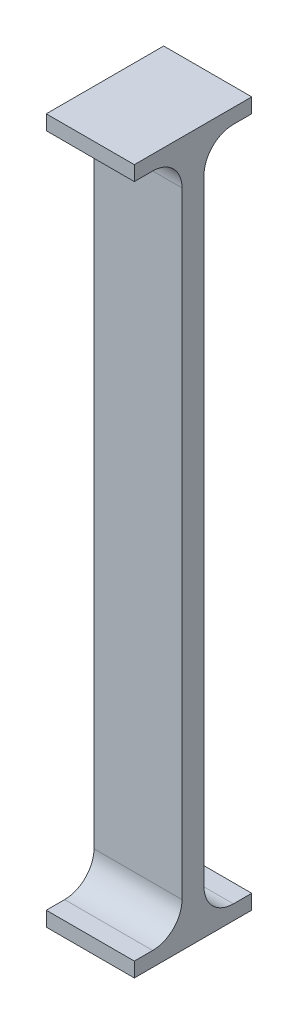
ISO-10303-21;
HEADER;
FILE_DESCRIPTION(('STEP AP214'),'2;1');
FILE_NAME('part.step','',(''),(''),'','','');
FILE_SCHEMA(('AUTOMOTIVE_DESIGN { 1 0 10303 214 1 1 1 1 }'));
ENDSEC;
DATA;
#1=APPLICATION_CONTEXT('core data for automotive mechanical design processes');
#2=APPLICATION_PROTOCOL_DEFINITION('international standard','automotive_design',2000,#1);
#3=PRODUCT_CONTEXT('',#1,'mechanical');
#4=PRODUCT('Part','Part','',(#3));
#5=PRODUCT_RELATED_PRODUCT_CATEGORY('part','',(#4));
#6=PRODUCT_DEFINITION_FORMATION('','',#4);
#7=PRODUCT_DEFINITION_CONTEXT('part definition',#1,'design');
#8=PRODUCT_DEFINITION('design','',#6,#7);
#9=PRODUCT_DEFINITION_SHAPE('','',#8);
#10=(LENGTH_UNIT() NAMED_UNIT(*) SI_UNIT(.MILLI.,.METRE.));
#11=(NAMED_UNIT(*) PLANE_ANGLE_UNIT() SI_UNIT($,.RADIAN.));
#12=(NAMED_UNIT(*) SI_UNIT($,.STERADIAN.) SOLID_ANGLE_UNIT());
#13=UNCERTAINTY_MEASURE_WITH_UNIT(LENGTH_MEASURE(1.E-05),#10,'distance_accuracy_value','');
#14=(GEOMETRIC_REPRESENTATION_CONTEXT(3) GLOBAL_UNCERTAINTY_ASSIGNED_CONTEXT((#13)) GLOBAL_UNIT_ASSIGNED_CONTEXT((#10,
#11,#12)) REPRESENTATION_CONTEXT('',''));
#15=CARTESIAN_POINT('',(0.,0.,0.));
#16=DIRECTION('',(0.,0.,1.));
#17=DIRECTION('',(1.,0.,0.));
#18=AXIS2_PLACEMENT_3D('',#15,#16,#17);
#19=CARTESIAN_POINT('',(0.,0.,3.75));
#20=DIRECTION('',(0.,0.,-1.));
#21=DIRECTION('',(-1.,0.,0.));
#22=AXIS2_PLACEMENT_3D('',#19,#20,#21);
#23=PLANE('',#22);
#24=DIRECTION('',(0.,-1.,0.));
#25=VECTOR('',#24,1.);
#26=CARTESIAN_POINT('',(-15.,0.,3.75));
#27=LINE('',#26,#25);
#28=CARTESIAN_POINT('',(-15.0000000000001,224.95,3.75));
#29=VERTEX_POINT('',#28);
#30=CARTESIAN_POINT('',(-15.,15.,3.75));
#31=VERTEX_POINT('',#30);
#32=EDGE_CURVE('E211',#29,#31,#27,.T.);
#33=ORIENTED_EDGE('',*,*,#32,.T.);
#34=DIRECTION('',(-1.,0.,0.));
#35=VECTOR('',#34,1.);
#36=CARTESIAN_POINT('',(15.,15.,3.75));
#37=LINE('',#36,#35);
#38=CARTESIAN_POINT('',(15.,15.,3.75));
#39=VERTEX_POINT('',#38);
#40=EDGE_CURVE('E60',#31,#39,#37,.F.);
#41=ORIENTED_EDGE('',*,*,#40,.T.);
#42=DIRECTION('',(0.,1.,0.));
#43=VECTOR('',#42,1.);
#44=CARTESIAN_POINT('',(15.,0.,3.75));
#45=LINE('',#44,#43);
#46=CARTESIAN_POINT('',(15.,224.95,3.75));
#47=VERTEX_POINT('',#46);
#48=EDGE_CURVE('E213',#39,#47,#45,.T.);
#49=ORIENTED_EDGE('',*,*,#48,.T.);
#50=DIRECTION('',(1.,0.,0.));
#51=VECTOR('',#50,1.);
#52=CARTESIAN_POINT('',(-15.0000000000001,224.95,3.75));
#53=LINE('',#52,#51);
#54=EDGE_CURVE('E234',#47,#29,#53,.F.);
#55=ORIENTED_EDGE('',*,*,#54,.T.);
#56=EDGE_LOOP('',(#33,#41,#49,#55));
#57=FACE_BOUND('',#56,.T.);
#58=ADVANCED_FACE('F39',(#57),#23,.F.);
#59=CARTESIAN_POINT('',(0.,0.,-3.75));
#60=DIRECTION('',(0.,0.,-1.));
#61=DIRECTION('',(-1.,0.,0.));
#62=AXIS2_PLACEMENT_3D('',#59,#60,#61);
#63=PLANE('',#62);
#64=DIRECTION('',(0.,1.,0.));
#65=VECTOR('',#64,1.);
#66=CARTESIAN_POINT('',(15.,0.,-3.75));
#67=LINE('',#66,#65);
#68=CARTESIAN_POINT('',(15.,15.,-3.75));
#69=VERTEX_POINT('',#68);
#70=CARTESIAN_POINT('',(15.,224.95,-3.75));
#71=VERTEX_POINT('',#70);
#72=EDGE_CURVE('E214',#69,#71,#67,.T.);
#73=ORIENTED_EDGE('',*,*,#72,.F.);
#74=DIRECTION('',(-1.,0.,0.));
#75=VECTOR('',#74,1.);
#76=CARTESIAN_POINT('',(0.,15.,-3.75));
#77=LINE('',#76,#75);
#78=CARTESIAN_POINT('',(-15.,15.,-3.75));
#79=VERTEX_POINT('',#78);
#80=EDGE_CURVE('E244',#69,#79,#77,.T.);
#81=ORIENTED_EDGE('',*,*,#80,.T.);
#82=DIRECTION('',(0.,-1.,0.));
#83=VECTOR('',#82,1.);
#84=CARTESIAN_POINT('',(-15.,0.,-3.75));
#85=LINE('',#84,#83);
#86=CARTESIAN_POINT('',(-15.0000000000001,224.95,-3.75));
#87=VERTEX_POINT('',#86);
#88=EDGE_CURVE('E210',#87,#79,#85,.T.);
#89=ORIENTED_EDGE('',*,*,#88,.F.);
#90=DIRECTION('',(1.,0.,0.));
#91=VECTOR('',#90,1.);
#92=CARTESIAN_POINT('',(0.,224.95,-3.75));
#93=LINE('',#92,#91);
#94=EDGE_CURVE('E227',#87,#71,#93,.T.);
#95=ORIENTED_EDGE('',*,*,#94,.T.);
#96=EDGE_LOOP('',(#73,#81,#89,#95));
#97=FACE_BOUND('',#96,.T.);
#98=ADVANCED_FACE('F266',(#97),#63,.T.);
#99=CARTESIAN_POINT('',(-15.,0.,3.75));
#100=DIRECTION('',(1.,0.,0.));
#101=DIRECTION('',(0.,1.,0.));
#102=AXIS2_PLACEMENT_3D('',#99,#100,#101);
#103=PLANE('',#102);
#104=DIRECTION('',(0.,0.,-1.));
#105=VECTOR('',#104,1.);
#106=CARTESIAN_POINT('',(-15.0000000000001,239.95,3.75));
#107=LINE('',#106,#105);
#108=CARTESIAN_POINT('',(-15.0000000000001,239.95,20.));
#109=VERTEX_POINT('',#108);
#110=CARTESIAN_POINT('',(-15.0000000000001,239.95,-20.));
#111=VERTEX_POINT('',#110);
#112=EDGE_CURVE('E216',#109,#111,#107,.T.);
#113=ORIENTED_EDGE('',*,*,#112,.T.);
#114=DIRECTION('',(0.,-1.,0.));
#115=VECTOR('',#114,1.);
#116=CARTESIAN_POINT('',(-15.0000000000001,239.95,-20.));
#117=LINE('',#116,#115);
#118=CARTESIAN_POINT('',(-15.0000000000001,234.95,-20.));
#119=VERTEX_POINT('',#118);
#120=EDGE_CURVE('E304',#111,#119,#117,.T.);
#121=ORIENTED_EDGE('',*,*,#120,.T.);
#122=DIRECTION('',(0.,0.,-1.));
#123=VECTOR('',#122,1.);
#124=CARTESIAN_POINT('',(-15.0000000000001,234.95,20.));
#125=LINE('',#124,#123);
#126=CARTESIAN_POINT('',(-15.0000000000001,234.95,-13.75));
#127=VERTEX_POINT('',#126);
#128=EDGE_CURVE('E177',#127,#119,#125,.T.);
#129=ORIENTED_EDGE('',*,*,#128,.F.);
#130=CARTESIAN_POINT('',(-15.0000000000001,224.95,-13.75));
#131=DIRECTION('',(1.,0.,0.));
#132=DIRECTION('',(0.,1.,0.));
#133=AXIS2_PLACEMENT_3D('',#130,#131,#132);
#134=CIRCLE('',#133,10.);
#135=EDGE_CURVE('E238',#127,#87,#134,.T.);
#136=ORIENTED_EDGE('',*,*,#135,.T.);
#137=ORIENTED_EDGE('',*,*,#88,.T.);
#138=CARTESIAN_POINT('',(-15.,15.,-13.75));
#139=DIRECTION('',(1.,0.,0.));
#140=DIRECTION('',(0.,1.,0.));
#141=AXIS2_PLACEMENT_3D('',#138,#139,#140);
#142=CIRCLE('',#141,10.);
#143=CARTESIAN_POINT('',(-15.,5.,-13.75));
#144=VERTEX_POINT('',#143);
#145=EDGE_CURVE('E253',#79,#144,#142,.T.);
#146=ORIENTED_EDGE('',*,*,#145,.T.);
#147=DIRECTION('',(0.,0.,-1.));
#148=VECTOR('',#147,1.);
#149=CARTESIAN_POINT('',(-15.,5.,20.));
#150=LINE('',#149,#148);
#151=CARTESIAN_POINT('',(-15.,5.,-20.));
#152=VERTEX_POINT('',#151);
#153=EDGE_CURVE('E195',#144,#152,#150,.T.);
#154=ORIENTED_EDGE('',*,*,#153,.T.);
#155=DIRECTION('',(0.,-1.,0.));
#156=VECTOR('',#155,1.);
#157=CARTESIAN_POINT('',(-15.,0.,-20.));
#158=LINE('',#157,#156);
#159=CARTESIAN_POINT('',(-15.,0.,-20.));
#160=VERTEX_POINT('',#159);
#161=EDGE_CURVE('E176',#152,#160,#158,.T.);
#162=ORIENTED_EDGE('',*,*,#161,.T.);
#163=DIRECTION('',(0.,0.,-1.));
#164=VECTOR('',#163,1.);
#165=CARTESIAN_POINT('',(-15.,0.,3.75));
#166=LINE('',#165,#164);
#167=CARTESIAN_POINT('',(-15.,0.,20.));
#168=VERTEX_POINT('',#167);
#169=EDGE_CURVE('E225',#168,#160,#166,.T.);
#170=ORIENTED_EDGE('',*,*,#169,.F.);
#171=DIRECTION('',(0.,-1.,0.));
#172=VECTOR('',#171,1.);
#173=CARTESIAN_POINT('',(-15.,0.,20.));
#174=LINE('',#173,#172);
#175=CARTESIAN_POINT('',(-15.,5.,20.));
#176=VERTEX_POINT('',#175);
#177=EDGE_CURVE('E185',#176,#168,#174,.T.);
#178=ORIENTED_EDGE('',*,*,#177,.F.);
#179=CARTESIAN_POINT('',(-15.,5.,13.75));
#180=VERTEX_POINT('',#179);
#181=EDGE_CURVE('E204',#176,#180,#150,.T.);
#182=ORIENTED_EDGE('',*,*,#181,.T.);
#183=CARTESIAN_POINT('',(-15.,15.,13.75));
#184=DIRECTION('',(1.,0.,0.));
#185=DIRECTION('',(0.,1.,0.));
#186=AXIS2_PLACEMENT_3D('',#183,#184,#185);
#187=CIRCLE('',#186,10.);
#188=EDGE_CURVE('E47',#180,#31,#187,.T.);
#189=ORIENTED_EDGE('',*,*,#188,.T.);
#190=ORIENTED_EDGE('',*,*,#32,.F.);
#191=CARTESIAN_POINT('',(-15.0000000000001,224.95,13.75));
#192=DIRECTION('',(1.,0.,0.));
#193=DIRECTION('',(0.,1.,0.));
#194=AXIS2_PLACEMENT_3D('',#191,#192,#193);
#195=CIRCLE('',#194,10.);
#196=CARTESIAN_POINT('',(-15.0000000000001,234.95,13.75));
#197=VERTEX_POINT('',#196);
#198=EDGE_CURVE('E175',#29,#197,#195,.T.);
#199=ORIENTED_EDGE('',*,*,#198,.T.);
#200=CARTESIAN_POINT('',(-15.0000000000001,234.95,20.));
#201=VERTEX_POINT('',#200);
#202=EDGE_CURVE('E156',#201,#197,#125,.T.);
#203=ORIENTED_EDGE('',*,*,#202,.F.);
#204=DIRECTION('',(0.,-1.,0.));
#205=VECTOR('',#204,1.);
#206=CARTESIAN_POINT('',(-15.0000000000001,239.95,20.));
#207=LINE('',#206,#205);
#208=EDGE_CURVE('E164',#109,#201,#207,.T.);
#209=ORIENTED_EDGE('',*,*,#208,.F.);
#210=EDGE_LOOP('',(#113,#121,#129,#136,#137,#146,#154,#162,#170,#178,#182,#189,#190,#199,#203,#209));
#211=FACE_BOUND('',#210,.T.);
#212=ADVANCED_FACE('F173',(#211),#103,.F.);
#213=CARTESIAN_POINT('',(-15.,0.,3.75));
#214=DIRECTION('',(0.,1.,0.));
#215=DIRECTION('',(-1.,0.,0.));
#216=AXIS2_PLACEMENT_3D('',#213,#214,#215);
#217=PLANE('',#216);
#218=ORIENTED_EDGE('',*,*,#169,.T.);
#219=DIRECTION('',(1.,0.,0.));
#220=VECTOR('',#219,1.);
#221=CARTESIAN_POINT('',(-15.,0.,-20.));
#222=LINE('',#221,#220);
#223=CARTESIAN_POINT('',(15.,0.,-20.));
#224=VERTEX_POINT('',#223);
#225=EDGE_CURVE('E180',#160,#224,#222,.T.);
#226=ORIENTED_EDGE('',*,*,#225,.T.);
#227=DIRECTION('',(0.,0.,-1.));
#228=VECTOR('',#227,1.);
#229=CARTESIAN_POINT('',(15.,0.,3.75));
#230=LINE('',#229,#228);
#231=CARTESIAN_POINT('',(15.,0.,20.));
#232=VERTEX_POINT('',#231);
#233=EDGE_CURVE('E223',#232,#224,#230,.T.);
#234=ORIENTED_EDGE('',*,*,#233,.F.);
#235=DIRECTION('',(1.,0.,0.));
#236=VECTOR('',#235,1.);
#237=CARTESIAN_POINT('',(-15.,0.,20.));
#238=LINE('',#237,#236);
#239=EDGE_CURVE('E188',#168,#232,#238,.T.);
#240=ORIENTED_EDGE('',*,*,#239,.F.);
#241=EDGE_LOOP('',(#218,#226,#234,#240));
#242=FACE_BOUND('',#241,.T.);
#243=ADVANCED_FACE('F282',(#242),#217,.F.);
#244=CARTESIAN_POINT('',(15.,0.,3.75));
#245=DIRECTION('',(-1.,0.,0.));
#246=DIRECTION('',(0.,0.,1.));
#247=AXIS2_PLACEMENT_3D('',#244,#245,#246);
#248=PLANE('',#247);
#249=DIRECTION('',(0.,0.,-1.));
#250=VECTOR('',#249,1.);
#251=CARTESIAN_POINT('',(15.,239.95,3.75));
#252=LINE('',#251,#250);
#253=CARTESIAN_POINT('',(15.,239.95,20.));
#254=VERTEX_POINT('',#253);
#255=CARTESIAN_POINT('',(15.,239.95,-20.));
#256=VERTEX_POINT('',#255);
#257=EDGE_CURVE('E221',#254,#256,#252,.T.);
#258=ORIENTED_EDGE('',*,*,#257,.F.);
#259=DIRECTION('',(0.,1.,0.));
#260=VECTOR('',#259,1.);
#261=CARTESIAN_POINT('',(15.,239.95,20.));
#262=LINE('',#261,#260);
#263=CARTESIAN_POINT('',(15.,234.95,20.));
#264=VERTEX_POINT('',#263);
#265=EDGE_CURVE('E163',#264,#254,#262,.T.);
#266=ORIENTED_EDGE('',*,*,#265,.F.);
#267=DIRECTION('',(0.,0.,-1.));
#268=VECTOR('',#267,1.);
#269=CARTESIAN_POINT('',(15.,234.95,20.));
#270=LINE('',#269,#268);
#271=CARTESIAN_POINT('',(15.,234.95,13.75));
#272=VERTEX_POINT('',#271);
#273=EDGE_CURVE('E159',#264,#272,#270,.T.);
#274=ORIENTED_EDGE('',*,*,#273,.T.);
#275=CARTESIAN_POINT('',(15.,224.95,13.75));
#276=DIRECTION('',(-1.,0.,0.));
#277=DIRECTION('',(0.,0.,1.));
#278=AXIS2_PLACEMENT_3D('',#275,#276,#277);
#279=CIRCLE('',#278,10.);
#280=EDGE_CURVE('E240',#272,#47,#279,.T.);
#281=ORIENTED_EDGE('',*,*,#280,.T.);
#282=ORIENTED_EDGE('',*,*,#48,.F.);
#283=CARTESIAN_POINT('',(15.,15.,13.75));
#284=DIRECTION('',(-1.,0.,0.));
#285=DIRECTION('',(0.,0.,1.));
#286=AXIS2_PLACEMENT_3D('',#283,#284,#285);
#287=CIRCLE('',#286,10.);
#288=CARTESIAN_POINT('',(15.,5.,13.75));
#289=VERTEX_POINT('',#288);
#290=EDGE_CURVE('E11',#39,#289,#287,.T.);
#291=ORIENTED_EDGE('',*,*,#290,.T.);
#292=DIRECTION('',(0.,0.,-1.));
#293=VECTOR('',#292,1.);
#294=CARTESIAN_POINT('',(15.,5.,20.));
#295=LINE('',#294,#293);
#296=CARTESIAN_POINT('',(15.,5.,20.));
#297=VERTEX_POINT('',#296);
#298=EDGE_CURVE('E207',#297,#289,#295,.T.);
#299=ORIENTED_EDGE('',*,*,#298,.F.);
#300=DIRECTION('',(0.,1.,0.));
#301=VECTOR('',#300,1.);
#302=CARTESIAN_POINT('',(15.,0.,20.));
#303=LINE('',#302,#301);
#304=EDGE_CURVE('E192',#232,#297,#303,.T.);
#305=ORIENTED_EDGE('',*,*,#304,.F.);
#306=ORIENTED_EDGE('',*,*,#233,.T.);
#307=DIRECTION('',(0.,1.,0.));
#308=VECTOR('',#307,1.);
#309=CARTESIAN_POINT('',(15.,0.,-20.));
#310=LINE('',#309,#308);
#311=CARTESIAN_POINT('',(15.,5.,-20.));
#312=VERTEX_POINT('',#311);
#313=EDGE_CURVE('E199',#224,#312,#310,.T.);
#314=ORIENTED_EDGE('',*,*,#313,.T.);
#315=CARTESIAN_POINT('',(15.,5.,-13.75));
#316=VERTEX_POINT('',#315);
#317=EDGE_CURVE('E206',#316,#312,#295,.T.);
#318=ORIENTED_EDGE('',*,*,#317,.F.);
#319=CARTESIAN_POINT('',(15.,15.,-13.75));
#320=DIRECTION('',(-1.,0.,0.));
#321=DIRECTION('',(0.,0.,1.));
#322=AXIS2_PLACEMENT_3D('',#319,#320,#321);
#323=CIRCLE('',#322,10.);
#324=EDGE_CURVE('E255',#316,#69,#323,.T.);
#325=ORIENTED_EDGE('',*,*,#324,.T.);
#326=ORIENTED_EDGE('',*,*,#72,.T.);
#327=CARTESIAN_POINT('',(15.,224.95,-13.75));
#328=DIRECTION('',(-1.,0.,0.));
#329=DIRECTION('',(0.,0.,1.));
#330=AXIS2_PLACEMENT_3D('',#327,#328,#329);
#331=CIRCLE('',#330,10.);
#332=CARTESIAN_POINT('',(15.,234.95,-13.75));
#333=VERTEX_POINT('',#332);
#334=EDGE_CURVE('E236',#71,#333,#331,.T.);
#335=ORIENTED_EDGE('',*,*,#334,.T.);
#336=CARTESIAN_POINT('',(15.,234.95,-20.));
#337=VERTEX_POINT('',#336);
#338=EDGE_CURVE('E297',#333,#337,#270,.T.);
#339=ORIENTED_EDGE('',*,*,#338,.T.);
#340=DIRECTION('',(0.,1.,0.));
#341=VECTOR('',#340,1.);
#342=CARTESIAN_POINT('',(15.,239.95,-20.));
#343=LINE('',#342,#341);
#344=EDGE_CURVE('E309',#337,#256,#343,.T.);
#345=ORIENTED_EDGE('',*,*,#344,.T.);
#346=EDGE_LOOP('',(#258,#266,#274,#281,#282,#291,#299,#305,#306,#314,#318,#325,#326,#335,#339,#345));
#347=FACE_BOUND('',#346,.T.);
#348=ADVANCED_FACE('F260',(#347),#248,.F.);
#349=CARTESIAN_POINT('',(-15.0000000000001,239.95,3.75));
#350=DIRECTION('',(0.,-1.,0.));
#351=DIRECTION('',(0.,0.,-1.));
#352=AXIS2_PLACEMENT_3D('',#349,#350,#351);
#353=PLANE('',#352);
#354=ORIENTED_EDGE('',*,*,#257,.T.);
#355=DIRECTION('',(-1.,0.,0.));
#356=VECTOR('',#355,1.);
#357=CARTESIAN_POINT('',(-15.0000000000001,239.95,-20.));
#358=LINE('',#357,#356);
#359=EDGE_CURVE('E171',#256,#111,#358,.T.);
#360=ORIENTED_EDGE('',*,*,#359,.T.);
#361=ORIENTED_EDGE('',*,*,#112,.F.);
#362=DIRECTION('',(-1.,0.,0.));
#363=VECTOR('',#362,1.);
#364=CARTESIAN_POINT('',(-15.0000000000001,239.95,20.));
#365=LINE('',#364,#363);
#366=EDGE_CURVE('E170',#254,#109,#365,.T.);
#367=ORIENTED_EDGE('',*,*,#366,.F.);
#368=EDGE_LOOP('',(#354,#360,#361,#367));
#369=FACE_BOUND('',#368,.T.);
#370=ADVANCED_FACE('F314',(#369),#353,.F.);
#371=CARTESIAN_POINT('',(0.,0.,-20.));
#372=DIRECTION('',(0.,0.,-1.));
#373=DIRECTION('',(-1.,0.,0.));
#374=AXIS2_PLACEMENT_3D('',#371,#372,#373);
#375=PLANE('',#374);
#376=ORIENTED_EDGE('',*,*,#161,.F.);
#377=DIRECTION('',(-1.,0.,0.));
#378=VECTOR('',#377,1.);
#379=CARTESIAN_POINT('',(-15.,5.,-20.));
#380=LINE('',#379,#378);
#381=EDGE_CURVE('E189',#312,#152,#380,.T.);
#382=ORIENTED_EDGE('',*,*,#381,.F.);
#383=ORIENTED_EDGE('',*,*,#313,.F.);
#384=ORIENTED_EDGE('',*,*,#225,.F.);
#385=EDGE_LOOP('',(#376,#382,#383,#384));
#386=FACE_BOUND('',#385,.T.);
#387=ADVANCED_FACE('F278',(#386),#375,.T.);
#388=CARTESIAN_POINT('',(-15.,5.,20.));
#389=DIRECTION('',(0.,-1.,0.));
#390=DIRECTION('',(0.,0.,-1.));
#391=AXIS2_PLACEMENT_3D('',#388,#389,#390);
#392=PLANE('',#391);
#393=ORIENTED_EDGE('',*,*,#153,.F.);
#394=DIRECTION('',(-1.,0.,0.));
#395=VECTOR('',#394,1.);
#396=CARTESIAN_POINT('',(-15.,5.,-13.75));
#397=LINE('',#396,#395);
#398=EDGE_CURVE('E247',#144,#316,#397,.F.);
#399=ORIENTED_EDGE('',*,*,#398,.T.);
#400=ORIENTED_EDGE('',*,*,#317,.T.);
#401=ORIENTED_EDGE('',*,*,#381,.T.);
#402=EDGE_LOOP('',(#393,#399,#400,#401));
#403=FACE_BOUND('',#402,.T.);
#404=ADVANCED_FACE('F272',(#403),#392,.F.);
#405=ORIENTED_EDGE('',*,*,#298,.T.);
#406=DIRECTION('',(-1.,0.,0.));
#407=VECTOR('',#406,1.);
#408=CARTESIAN_POINT('',(-15.,5.,13.75));
#409=LINE('',#408,#407);
#410=EDGE_CURVE('E249',#289,#180,#409,.T.);
#411=ORIENTED_EDGE('',*,*,#410,.T.);
#412=ORIENTED_EDGE('',*,*,#181,.F.);
#413=DIRECTION('',(-1.,0.,0.));
#414=VECTOR('',#413,1.);
#415=CARTESIAN_POINT('',(-15.,5.,20.));
#416=LINE('',#415,#414);
#417=EDGE_CURVE('E194',#297,#176,#416,.T.);
#418=ORIENTED_EDGE('',*,*,#417,.F.);
#419=EDGE_LOOP('',(#405,#411,#412,#418));
#420=FACE_BOUND('',#419,.T.);
#421=ADVANCED_FACE('F290',(#420),#392,.F.);
#422=CARTESIAN_POINT('',(0.,0.,20.));
#423=DIRECTION('',(0.,0.,-1.));
#424=DIRECTION('',(-1.,0.,0.));
#425=AXIS2_PLACEMENT_3D('',#422,#423,#424);
#426=PLANE('',#425);
#427=ORIENTED_EDGE('',*,*,#177,.T.);
#428=ORIENTED_EDGE('',*,*,#239,.T.);
#429=ORIENTED_EDGE('',*,*,#304,.T.);
#430=ORIENTED_EDGE('',*,*,#417,.T.);
#431=EDGE_LOOP('',(#427,#428,#429,#430));
#432=FACE_BOUND('',#431,.T.);
#433=ADVANCED_FACE('F285',(#432),#426,.F.);
#434=CARTESIAN_POINT('',(0.,0.,-20.));
#435=DIRECTION('',(0.,0.,1.));
#436=DIRECTION('',(1.,0.,0.));
#437=AXIS2_PLACEMENT_3D('',#434,#435,#436);
#438=PLANE('',#437);
#439=ORIENTED_EDGE('',*,*,#120,.F.);
#440=ORIENTED_EDGE('',*,*,#359,.F.);
#441=ORIENTED_EDGE('',*,*,#344,.F.);
#442=DIRECTION('',(1.,0.,0.));
#443=VECTOR('',#442,1.);
#444=CARTESIAN_POINT('',(-15.0000000000001,234.95,-20.));
#445=LINE('',#444,#443);
#446=EDGE_CURVE('E307',#119,#337,#445,.T.);
#447=ORIENTED_EDGE('',*,*,#446,.F.);
#448=EDGE_LOOP('',(#439,#440,#441,#447));
#449=FACE_BOUND('',#448,.T.);
#450=ADVANCED_FACE('F318',(#449),#438,.F.);
#451=CARTESIAN_POINT('',(-15.0000000000001,234.95,20.));
#452=DIRECTION('',(0.,1.,0.));
#453=DIRECTION('',(0.,0.,1.));
#454=AXIS2_PLACEMENT_3D('',#451,#452,#453);
#455=PLANE('',#454);
#456=ORIENTED_EDGE('',*,*,#338,.F.);
#457=DIRECTION('',(1.,0.,0.));
#458=VECTOR('',#457,1.);
#459=CARTESIAN_POINT('',(-15.0000000000001,234.95,-13.75));
#460=LINE('',#459,#458);
#461=EDGE_CURVE('E230',#333,#127,#460,.F.);
#462=ORIENTED_EDGE('',*,*,#461,.T.);
#463=ORIENTED_EDGE('',*,*,#128,.T.);
#464=ORIENTED_EDGE('',*,*,#446,.T.);
#465=EDGE_LOOP('',(#456,#462,#463,#464));
#466=FACE_BOUND('',#465,.T.);
#467=ADVANCED_FACE('F325',(#466),#455,.F.);
#468=ORIENTED_EDGE('',*,*,#202,.T.);
#469=DIRECTION('',(1.,0.,0.));
#470=VECTOR('',#469,1.);
#471=CARTESIAN_POINT('',(15.,234.95,13.75));
#472=LINE('',#471,#470);
#473=EDGE_CURVE('E232',#197,#272,#472,.T.);
#474=ORIENTED_EDGE('',*,*,#473,.T.);
#475=ORIENTED_EDGE('',*,*,#273,.F.);
#476=DIRECTION('',(1.,0.,0.));
#477=VECTOR('',#476,1.);
#478=CARTESIAN_POINT('',(-15.0000000000001,234.95,20.));
#479=LINE('',#478,#477);
#480=EDGE_CURVE('E151',#201,#264,#479,.T.);
#481=ORIENTED_EDGE('',*,*,#480,.F.);
#482=EDGE_LOOP('',(#468,#474,#475,#481));
#483=FACE_BOUND('',#482,.T.);
#484=ADVANCED_FACE('F153',(#483),#455,.F.);
#485=CARTESIAN_POINT('',(0.,0.,20.));
#486=DIRECTION('',(0.,0.,1.));
#487=DIRECTION('',(1.,0.,0.));
#488=AXIS2_PLACEMENT_3D('',#485,#486,#487);
#489=PLANE('',#488);
#490=ORIENTED_EDGE('',*,*,#208,.T.);
#491=ORIENTED_EDGE('',*,*,#480,.T.);
#492=ORIENTED_EDGE('',*,*,#265,.T.);
#493=ORIENTED_EDGE('',*,*,#366,.T.);
#494=EDGE_LOOP('',(#490,#491,#492,#493));
#495=FACE_BOUND('',#494,.T.);
#496=ADVANCED_FACE('F168',(#495),#489,.T.);
#497=CARTESIAN_POINT('',(0.,224.95,-13.75));
#498=DIRECTION('',(1.,0.,0.));
#499=DIRECTION('',(0.,0.,-1.));
#500=AXIS2_PLACEMENT_3D('',#497,#498,#499);
#501=CYLINDRICAL_SURFACE('',#500,10.);
#502=ORIENTED_EDGE('',*,*,#135,.F.);
#503=ORIENTED_EDGE('',*,*,#461,.F.);
#504=ORIENTED_EDGE('',*,*,#334,.F.);
#505=ORIENTED_EDGE('',*,*,#94,.F.);
#506=EDGE_LOOP('',(#502,#503,#504,#505));
#507=FACE_BOUND('',#506,.T.);
#508=ADVANCED_FACE('F324',(#507),#501,.F.);
#509=CARTESIAN_POINT('',(-15.0000000000001,224.95,13.75));
#510=DIRECTION('',(-1.,0.,0.));
#511=DIRECTION('',(0.,0.,1.));
#512=AXIS2_PLACEMENT_3D('',#509,#510,#511);
#513=CYLINDRICAL_SURFACE('',#512,10.);
#514=ORIENTED_EDGE('',*,*,#198,.F.);
#515=ORIENTED_EDGE('',*,*,#54,.F.);
#516=ORIENTED_EDGE('',*,*,#280,.F.);
#517=ORIENTED_EDGE('',*,*,#473,.F.);
#518=EDGE_LOOP('',(#514,#515,#516,#517));
#519=FACE_BOUND('',#518,.T.);
#520=ADVANCED_FACE('F296',(#519),#513,.F.);
#521=CARTESIAN_POINT('',(0.,15.,-13.75));
#522=DIRECTION('',(-1.,0.,0.));
#523=DIRECTION('',(0.,0.,1.));
#524=AXIS2_PLACEMENT_3D('',#521,#522,#523);
#525=CYLINDRICAL_SURFACE('',#524,10.);
#526=ORIENTED_EDGE('',*,*,#324,.F.);
#527=ORIENTED_EDGE('',*,*,#398,.F.);
#528=ORIENTED_EDGE('',*,*,#145,.F.);
#529=ORIENTED_EDGE('',*,*,#80,.F.);
#530=EDGE_LOOP('',(#526,#527,#528,#529));
#531=FACE_BOUND('',#530,.T.);
#532=ADVANCED_FACE('F269',(#531),#525,.F.);
#533=CARTESIAN_POINT('',(-15.,15.,13.75));
#534=DIRECTION('',(1.,0.,0.));
#535=DIRECTION('',(0.,0.,-1.));
#536=AXIS2_PLACEMENT_3D('',#533,#534,#535);
#537=CYLINDRICAL_SURFACE('',#536,10.);
#538=ORIENTED_EDGE('',*,*,#290,.F.);
#539=ORIENTED_EDGE('',*,*,#40,.F.);
#540=ORIENTED_EDGE('',*,*,#188,.F.);
#541=ORIENTED_EDGE('',*,*,#410,.F.);
#542=EDGE_LOOP('',(#538,#539,#540,#541));
#543=FACE_BOUND('',#542,.T.);
#544=ADVANCED_FACE('F41',(#543),#537,.F.);
#545=CLOSED_SHELL('',(#58,#98,#212,#243,#348,#370,#387,#404,#421,#433,#450,#467,#484,#496,#508,
#520,#532,#544));
#546=MANIFOLD_SOLID_BREP('B2',#545);
#547=ADVANCED_BREP_SHAPE_REPRESENTATION('',(#18,#546),#14);
#548=SHAPE_DEFINITION_REPRESENTATION(#9,#547);
ENDSEC;
END-ISO-10303-21;
